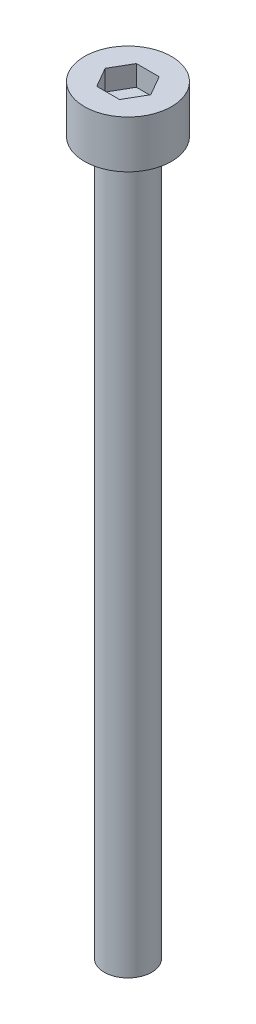
ISO-10303-21;
HEADER;
FILE_DESCRIPTION(('STEP AP214'),'2;1');
FILE_NAME('part.step','',(''),(''),'','','');
FILE_SCHEMA(('AUTOMOTIVE_DESIGN { 1 0 10303 214 1 1 1 1 }'));
ENDSEC;
DATA;
#1=APPLICATION_CONTEXT('core data for automotive mechanical design processes');
#2=APPLICATION_PROTOCOL_DEFINITION('international standard','automotive_design',2000,#1);
#3=PRODUCT_CONTEXT('',#1,'mechanical');
#4=PRODUCT('Part','Part','',(#3));
#5=PRODUCT_RELATED_PRODUCT_CATEGORY('part','',(#4));
#6=PRODUCT_DEFINITION_FORMATION('','',#4);
#7=PRODUCT_DEFINITION_CONTEXT('part definition',#1,'design');
#8=PRODUCT_DEFINITION('design','',#6,#7);
#9=PRODUCT_DEFINITION_SHAPE('','',#8);
#10=(LENGTH_UNIT() NAMED_UNIT(*) SI_UNIT(.MILLI.,.METRE.));
#11=(NAMED_UNIT(*) PLANE_ANGLE_UNIT() SI_UNIT($,.RADIAN.));
#12=(NAMED_UNIT(*) SI_UNIT($,.STERADIAN.) SOLID_ANGLE_UNIT());
#13=UNCERTAINTY_MEASURE_WITH_UNIT(LENGTH_MEASURE(1.E-05),#10,'distance_accuracy_value','');
#14=(GEOMETRIC_REPRESENTATION_CONTEXT(3) GLOBAL_UNCERTAINTY_ASSIGNED_CONTEXT((#13)) GLOBAL_UNIT_ASSIGNED_CONTEXT((#10,
#11,#12)) REPRESENTATION_CONTEXT('',''));
#15=CARTESIAN_POINT('',(0.,0.,0.));
#16=DIRECTION('',(0.,0.,1.));
#17=DIRECTION('',(1.,0.,0.));
#18=AXIS2_PLACEMENT_3D('',#15,#16,#17);
#19=CARTESIAN_POINT('',(0.,3.,0.));
#20=DIRECTION('',(0.,-1.,0.));
#21=DIRECTION('',(0.,0.,-1.));
#22=AXIS2_PLACEMENT_3D('',#19,#20,#21);
#23=CYLINDRICAL_SURFACE('',#22,2.75);
#24=CARTESIAN_POINT('',(0.,3.,0.));
#25=DIRECTION('',(0.,1.,0.));
#26=DIRECTION('',(0.,0.,1.));
#27=AXIS2_PLACEMENT_3D('',#24,#25,#26);
#28=CIRCLE('',#27,2.75);
#29=CARTESIAN_POINT('',(0.,3.,2.75));
#30=VERTEX_POINT('',#29);
#31=EDGE_CURVE('E45',#30,#30,#28,.T.);
#32=ORIENTED_EDGE('',*,*,#31,.F.);
#33=EDGE_LOOP('',(#32));
#34=FACE_BOUND('',#33,.T.);
#35=CARTESIAN_POINT('',(0.,0.,0.));
#36=DIRECTION('',(0.,1.,0.));
#37=DIRECTION('',(0.,0.,1.));
#38=AXIS2_PLACEMENT_3D('',#35,#36,#37);
#39=CIRCLE('',#38,2.75);
#40=CARTESIAN_POINT('',(0.,0.,2.75));
#41=VERTEX_POINT('',#40);
#42=EDGE_CURVE('E40',#41,#41,#39,.T.);
#43=ORIENTED_EDGE('',*,*,#42,.T.);
#44=EDGE_LOOP('',(#43));
#45=FACE_BOUND('',#44,.T.);
#46=ADVANCED_FACE('F37',(#34,#45),#23,.T.);
#47=CARTESIAN_POINT('',(0.,3.,0.));
#48=DIRECTION('',(0.,1.,0.));
#49=DIRECTION('',(0.,0.,1.));
#50=AXIS2_PLACEMENT_3D('',#47,#48,#49);
#51=PLANE('',#50);
#52=DIRECTION('',(0.5,0.,-0.866025403784439));
#53=VECTOR('',#52,1.);
#54=CARTESIAN_POINT('',(0.721687836487032,3.,1.25));
#55=LINE('',#54,#53);
#56=CARTESIAN_POINT('',(0.721687836487032,3.,1.25));
#57=VERTEX_POINT('',#56);
#58=CARTESIAN_POINT('',(1.44337567297406,3.,0.));
#59=VERTEX_POINT('',#58);
#60=EDGE_CURVE('E53',#57,#59,#55,.T.);
#61=ORIENTED_EDGE('',*,*,#60,.F.);
#62=DIRECTION('',(1.,0.,0.));
#63=VECTOR('',#62,1.);
#64=CARTESIAN_POINT('',(-0.721687836487033,3.,1.25));
#65=LINE('',#64,#63);
#66=CARTESIAN_POINT('',(-0.721687836487033,3.,1.25));
#67=VERTEX_POINT('',#66);
#68=EDGE_CURVE('E137',#67,#57,#65,.T.);
#69=ORIENTED_EDGE('',*,*,#68,.F.);
#70=DIRECTION('',(0.5,0.,0.866025403784439));
#71=VECTOR('',#70,1.);
#72=CARTESIAN_POINT('',(-1.44337567297407,3.,0.));
#73=LINE('',#72,#71);
#74=CARTESIAN_POINT('',(-1.44337567297407,3.,0.));
#75=VERTEX_POINT('',#74);
#76=EDGE_CURVE('E135',#75,#67,#73,.T.);
#77=ORIENTED_EDGE('',*,*,#76,.F.);
#78=DIRECTION('',(-0.5,0.,0.866025403784438));
#79=VECTOR('',#78,1.);
#80=CARTESIAN_POINT('',(-0.721687836487033,3.,-1.25));
#81=LINE('',#80,#79);
#82=CARTESIAN_POINT('',(-0.721687836487033,3.,-1.25));
#83=VERTEX_POINT('',#82);
#84=EDGE_CURVE('E101',#83,#75,#81,.T.);
#85=ORIENTED_EDGE('',*,*,#84,.F.);
#86=DIRECTION('',(-1.,0.,0.));
#87=VECTOR('',#86,1.);
#88=CARTESIAN_POINT('',(0.721687836487032,3.,-1.25));
#89=LINE('',#88,#87);
#90=CARTESIAN_POINT('',(0.721687836487032,3.,-1.25));
#91=VERTEX_POINT('',#90);
#92=EDGE_CURVE('E131',#91,#83,#89,.T.);
#93=ORIENTED_EDGE('',*,*,#92,.F.);
#94=DIRECTION('',(-0.5,0.,-0.866025403784439));
#95=VECTOR('',#94,1.);
#96=CARTESIAN_POINT('',(1.44337567297406,3.,0.));
#97=LINE('',#96,#95);
#98=EDGE_CURVE('E127',#59,#91,#97,.T.);
#99=ORIENTED_EDGE('',*,*,#98,.F.);
#100=EDGE_LOOP('',(#61,#69,#77,#85,#93,#99));
#101=FACE_BOUND('',#100,.T.);
#102=ORIENTED_EDGE('',*,*,#31,.T.);
#103=EDGE_LOOP('',(#102));
#104=FACE_BOUND('',#103,.T.);
#105=ADVANCED_FACE('F155',(#101,#104),#51,.T.);
#106=CARTESIAN_POINT('',(0.,0.,0.));
#107=DIRECTION('',(0.,1.,0.));
#108=DIRECTION('',(0.,0.,1.));
#109=AXIS2_PLACEMENT_3D('',#106,#107,#108);
#110=PLANE('',#109);
#111=CARTESIAN_POINT('',(0.,0.,0.));
#112=DIRECTION('',(0.,-1.,0.));
#113=DIRECTION('',(0.,0.,-1.));
#114=AXIS2_PLACEMENT_3D('',#111,#112,#113);
#115=CIRCLE('',#114,1.5);
#116=CARTESIAN_POINT('',(0.,0.,-1.5));
#117=VERTEX_POINT('',#116);
#118=EDGE_CURVE('E11',#117,#117,#115,.T.);
#119=ORIENTED_EDGE('',*,*,#118,.F.);
#120=EDGE_LOOP('',(#119));
#121=FACE_BOUND('',#120,.T.);
#122=ORIENTED_EDGE('',*,*,#42,.F.);
#123=EDGE_LOOP('',(#122));
#124=FACE_BOUND('',#123,.T.);
#125=ADVANCED_FACE('F152',(#121,#124),#110,.F.);
#126=CARTESIAN_POINT('',(0.721687836487032,1.7,1.25));
#127=DIRECTION('',(0.866025403784439,0.,0.5));
#128=DIRECTION('',(0.5,0.,-0.866025403784439));
#129=AXIS2_PLACEMENT_3D('',#126,#127,#128);
#130=PLANE('',#129);
#131=ORIENTED_EDGE('',*,*,#60,.T.);
#132=DIRECTION('',(0.,1.,0.));
#133=VECTOR('',#132,1.);
#134=CARTESIAN_POINT('',(1.44337567297406,1.7,0.));
#135=LINE('',#134,#133);
#136=CARTESIAN_POINT('',(1.44337567297406,1.7,0.));
#137=VERTEX_POINT('',#136);
#138=EDGE_CURVE('E83',#137,#59,#135,.T.);
#139=ORIENTED_EDGE('',*,*,#138,.F.);
#140=DIRECTION('',(0.5,0.,-0.866025403784439));
#141=VECTOR('',#140,1.);
#142=CARTESIAN_POINT('',(0.721687836487032,1.7,1.25));
#143=LINE('',#142,#141);
#144=CARTESIAN_POINT('',(0.721687836487032,1.7,1.25));
#145=VERTEX_POINT('',#144);
#146=EDGE_CURVE('E139',#145,#137,#143,.T.);
#147=ORIENTED_EDGE('',*,*,#146,.F.);
#148=DIRECTION('',(0.,1.,0.));
#149=VECTOR('',#148,1.);
#150=CARTESIAN_POINT('',(0.721687836487032,1.7,1.25));
#151=LINE('',#150,#149);
#152=EDGE_CURVE('E61',#145,#57,#151,.T.);
#153=ORIENTED_EDGE('',*,*,#152,.T.);
#154=EDGE_LOOP('',(#131,#139,#147,#153));
#155=FACE_BOUND('',#154,.T.);
#156=ADVANCED_FACE('F154',(#155),#130,.F.);
#157=CARTESIAN_POINT('',(-0.721687836487033,1.7,1.25));
#158=DIRECTION('',(0.,0.,1.));
#159=DIRECTION('',(1.,0.,0.));
#160=AXIS2_PLACEMENT_3D('',#157,#158,#159);
#161=PLANE('',#160);
#162=ORIENTED_EDGE('',*,*,#68,.T.);
#163=ORIENTED_EDGE('',*,*,#152,.F.);
#164=DIRECTION('',(1.,0.,0.));
#165=VECTOR('',#164,1.);
#166=CARTESIAN_POINT('',(-0.721687836487033,1.7,1.25));
#167=LINE('',#166,#165);
#168=CARTESIAN_POINT('',(-0.721687836487033,1.7,1.25));
#169=VERTEX_POINT('',#168);
#170=EDGE_CURVE('E113',#169,#145,#167,.T.);
#171=ORIENTED_EDGE('',*,*,#170,.F.);
#172=DIRECTION('',(0.,1.,0.));
#173=VECTOR('',#172,1.);
#174=CARTESIAN_POINT('',(-0.721687836487033,1.7,1.25));
#175=LINE('',#174,#173);
#176=EDGE_CURVE('E105',#169,#67,#175,.T.);
#177=ORIENTED_EDGE('',*,*,#176,.T.);
#178=EDGE_LOOP('',(#162,#163,#171,#177));
#179=FACE_BOUND('',#178,.T.);
#180=ADVANCED_FACE('F161',(#179),#161,.F.);
#181=CARTESIAN_POINT('',(-1.44337567297407,1.7,0.));
#182=DIRECTION('',(-0.866025403784439,0.,0.5));
#183=DIRECTION('',(0.5,0.,0.866025403784439));
#184=AXIS2_PLACEMENT_3D('',#181,#182,#183);
#185=PLANE('',#184);
#186=ORIENTED_EDGE('',*,*,#76,.T.);
#187=ORIENTED_EDGE('',*,*,#176,.F.);
#188=DIRECTION('',(0.5,0.,0.866025403784439));
#189=VECTOR('',#188,1.);
#190=CARTESIAN_POINT('',(-1.44337567297407,1.7,0.));
#191=LINE('',#190,#189);
#192=CARTESIAN_POINT('',(-1.44337567297407,1.7,0.));
#193=VERTEX_POINT('',#192);
#194=EDGE_CURVE('E109',#193,#169,#191,.T.);
#195=ORIENTED_EDGE('',*,*,#194,.F.);
#196=DIRECTION('',(0.,1.,0.));
#197=VECTOR('',#196,1.);
#198=CARTESIAN_POINT('',(-1.44337567297407,1.7,0.));
#199=LINE('',#198,#197);
#200=EDGE_CURVE('E94',#193,#75,#199,.T.);
#201=ORIENTED_EDGE('',*,*,#200,.T.);
#202=EDGE_LOOP('',(#186,#187,#195,#201));
#203=FACE_BOUND('',#202,.T.);
#204=ADVANCED_FACE('F110',(#203),#185,.F.);
#205=CARTESIAN_POINT('',(-0.721687836487033,1.7,-1.25));
#206=DIRECTION('',(-0.866025403784439,0.,-0.5));
#207=DIRECTION('',(-0.5,0.,0.866025403784439));
#208=AXIS2_PLACEMENT_3D('',#205,#206,#207);
#209=PLANE('',#208);
#210=ORIENTED_EDGE('',*,*,#84,.T.);
#211=ORIENTED_EDGE('',*,*,#200,.F.);
#212=DIRECTION('',(-0.5,0.,0.866025403784438));
#213=VECTOR('',#212,1.);
#214=CARTESIAN_POINT('',(-0.721687836487033,1.7,-1.25));
#215=LINE('',#214,#213);
#216=CARTESIAN_POINT('',(-0.721687836487033,1.7,-1.25));
#217=VERTEX_POINT('',#216);
#218=EDGE_CURVE('E98',#217,#193,#215,.T.);
#219=ORIENTED_EDGE('',*,*,#218,.F.);
#220=DIRECTION('',(0.,1.,0.));
#221=VECTOR('',#220,1.);
#222=CARTESIAN_POINT('',(-0.721687836487033,1.7,-1.25));
#223=LINE('',#222,#221);
#224=EDGE_CURVE('E106',#217,#83,#223,.T.);
#225=ORIENTED_EDGE('',*,*,#224,.T.);
#226=EDGE_LOOP('',(#210,#211,#219,#225));
#227=FACE_BOUND('',#226,.T.);
#228=ADVANCED_FACE('F96',(#227),#209,.F.);
#229=CARTESIAN_POINT('',(0.721687836487032,1.7,-1.25));
#230=DIRECTION('',(0.,0.,-1.));
#231=DIRECTION('',(-1.,0.,0.));
#232=AXIS2_PLACEMENT_3D('',#229,#230,#231);
#233=PLANE('',#232);
#234=ORIENTED_EDGE('',*,*,#92,.T.);
#235=ORIENTED_EDGE('',*,*,#224,.F.);
#236=DIRECTION('',(-1.,0.,0.));
#237=VECTOR('',#236,1.);
#238=CARTESIAN_POINT('',(0.721687836487032,1.7,-1.25));
#239=LINE('',#238,#237);
#240=CARTESIAN_POINT('',(0.721687836487032,1.7,-1.25));
#241=VERTEX_POINT('',#240);
#242=EDGE_CURVE('E119',#241,#217,#239,.T.);
#243=ORIENTED_EDGE('',*,*,#242,.F.);
#244=DIRECTION('',(0.,1.,0.));
#245=VECTOR('',#244,1.);
#246=CARTESIAN_POINT('',(0.721687836487032,1.7,-1.25));
#247=LINE('',#246,#245);
#248=EDGE_CURVE('E143',#241,#91,#247,.T.);
#249=ORIENTED_EDGE('',*,*,#248,.T.);
#250=EDGE_LOOP('',(#234,#235,#243,#249));
#251=FACE_BOUND('',#250,.T.);
#252=ADVANCED_FACE('F206',(#251),#233,.F.);
#253=CARTESIAN_POINT('',(1.44337567297406,1.7,0.));
#254=DIRECTION('',(0.866025403784439,0.,-0.5));
#255=DIRECTION('',(-0.5,0.,-0.866025403784439));
#256=AXIS2_PLACEMENT_3D('',#253,#254,#255);
#257=PLANE('',#256);
#258=ORIENTED_EDGE('',*,*,#98,.T.);
#259=ORIENTED_EDGE('',*,*,#248,.F.);
#260=DIRECTION('',(-0.5,0.,-0.866025403784439));
#261=VECTOR('',#260,1.);
#262=CARTESIAN_POINT('',(1.44337567297406,1.7,0.));
#263=LINE('',#262,#261);
#264=EDGE_CURVE('E121',#137,#241,#263,.T.);
#265=ORIENTED_EDGE('',*,*,#264,.F.);
#266=ORIENTED_EDGE('',*,*,#138,.T.);
#267=EDGE_LOOP('',(#258,#259,#265,#266));
#268=FACE_BOUND('',#267,.T.);
#269=ADVANCED_FACE('F215',(#268),#257,.F.);
#270=CARTESIAN_POINT('',(0.,1.7,0.));
#271=DIRECTION('',(0.,1.,0.));
#272=DIRECTION('',(0.,0.,1.));
#273=AXIS2_PLACEMENT_3D('',#270,#271,#272);
#274=PLANE('',#273);
#275=ORIENTED_EDGE('',*,*,#146,.T.);
#276=ORIENTED_EDGE('',*,*,#264,.T.);
#277=ORIENTED_EDGE('',*,*,#242,.T.);
#278=ORIENTED_EDGE('',*,*,#218,.T.);
#279=ORIENTED_EDGE('',*,*,#194,.T.);
#280=ORIENTED_EDGE('',*,*,#170,.T.);
#281=EDGE_LOOP('',(#275,#276,#277,#278,#279,#280));
#282=FACE_BOUND('',#281,.T.);
#283=ADVANCED_FACE('F116',(#282),#274,.T.);
#284=CARTESIAN_POINT('',(0.,-45.,0.));
#285=DIRECTION('',(0.,1.,0.));
#286=DIRECTION('',(0.,0.,1.));
#287=AXIS2_PLACEMENT_3D('',#284,#285,#286);
#288=CYLINDRICAL_SURFACE('',#287,1.5);
#289=CARTESIAN_POINT('',(0.,-45.,0.));
#290=DIRECTION('',(0.,-1.,0.));
#291=DIRECTION('',(0.,0.,-1.));
#292=AXIS2_PLACEMENT_3D('',#289,#290,#291);
#293=CIRCLE('',#292,1.5);
#294=CARTESIAN_POINT('',(0.,-45.,-1.5));
#295=VERTEX_POINT('',#294);
#296=EDGE_CURVE('E128',#295,#295,#293,.T.);
#297=ORIENTED_EDGE('',*,*,#296,.F.);
#298=EDGE_LOOP('',(#297));
#299=FACE_BOUND('',#298,.T.);
#300=ORIENTED_EDGE('',*,*,#118,.T.);
#301=EDGE_LOOP('',(#300));
#302=FACE_BOUND('',#301,.T.);
#303=ADVANCED_FACE('F233',(#299,#302),#288,.T.);
#304=CARTESIAN_POINT('',(0.,-45.,0.));
#305=DIRECTION('',(0.,-1.,0.));
#306=DIRECTION('',(0.,0.,-1.));
#307=AXIS2_PLACEMENT_3D('',#304,#305,#306);
#308=PLANE('',#307);
#309=ORIENTED_EDGE('',*,*,#296,.T.);
#310=EDGE_LOOP('',(#309));
#311=FACE_BOUND('',#310,.T.);
#312=ADVANCED_FACE('F247',(#311),#308,.T.);
#313=CLOSED_SHELL('',(#46,#105,#125,#156,#180,#204,#228,#252,#269,#283,#303,#312));
#314=MANIFOLD_SOLID_BREP('B2',#313);
#315=ADVANCED_BREP_SHAPE_REPRESENTATION('',(#18,#314),#14);
#316=SHAPE_DEFINITION_REPRESENTATION(#9,#315);
ENDSEC;
END-ISO-10303-21;
